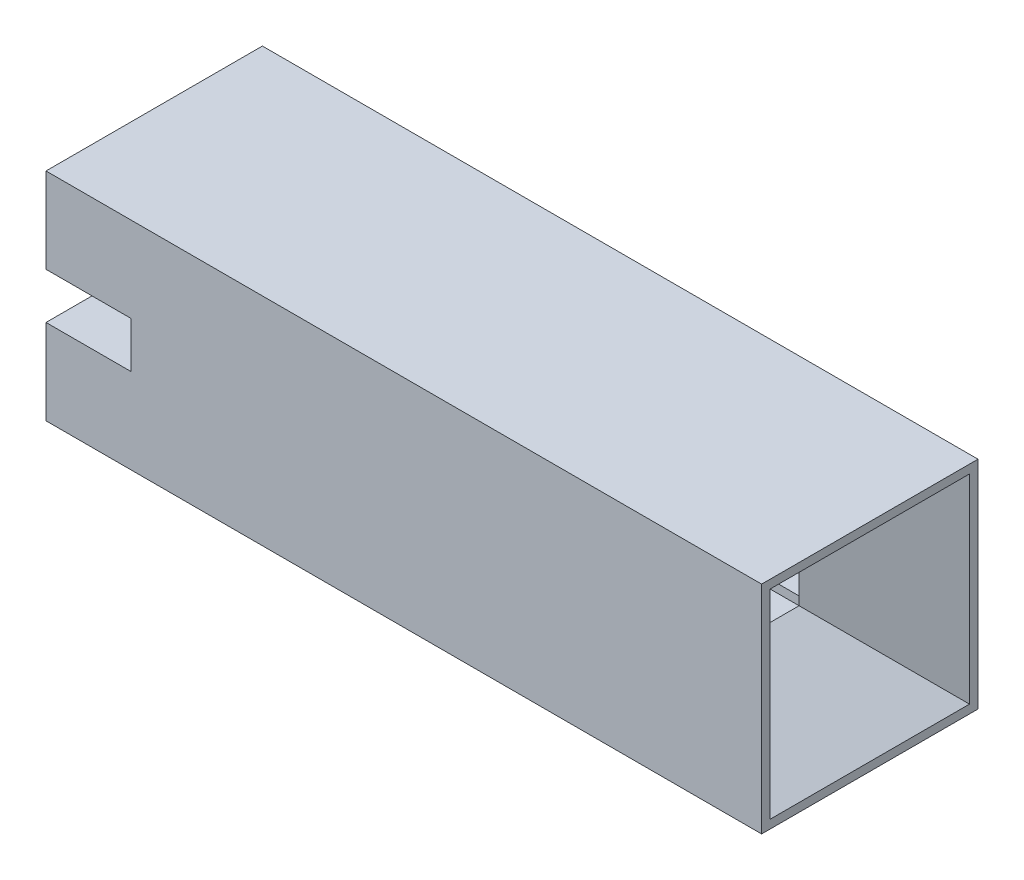
ISO-10303-21;
HEADER;
FILE_DESCRIPTION(('STEP AP214'),'2;1');
FILE_NAME('part.step','',(''),(''),'','','');
FILE_SCHEMA(('AUTOMOTIVE_DESIGN { 1 0 10303 214 1 1 1 1 }'));
ENDSEC;
DATA;
#1=APPLICATION_CONTEXT('core data for automotive mechanical design processes');
#2=APPLICATION_PROTOCOL_DEFINITION('international standard','automotive_design',2000,#1);
#3=PRODUCT_CONTEXT('',#1,'mechanical');
#4=PRODUCT('Part','Part','',(#3));
#5=PRODUCT_RELATED_PRODUCT_CATEGORY('part','',(#4));
#6=PRODUCT_DEFINITION_FORMATION('','',#4);
#7=PRODUCT_DEFINITION_CONTEXT('part definition',#1,'design');
#8=PRODUCT_DEFINITION('design','',#6,#7);
#9=PRODUCT_DEFINITION_SHAPE('','',#8);
#10=(LENGTH_UNIT() NAMED_UNIT(*) SI_UNIT(.MILLI.,.METRE.));
#11=(NAMED_UNIT(*) PLANE_ANGLE_UNIT() SI_UNIT($,.RADIAN.));
#12=(NAMED_UNIT(*) SI_UNIT($,.STERADIAN.) SOLID_ANGLE_UNIT());
#13=UNCERTAINTY_MEASURE_WITH_UNIT(LENGTH_MEASURE(1.E-05),#10,'distance_accuracy_value','');
#14=(GEOMETRIC_REPRESENTATION_CONTEXT(3) GLOBAL_UNCERTAINTY_ASSIGNED_CONTEXT((#13)) GLOBAL_UNIT_ASSIGNED_CONTEXT((#10,
#11,#12)) REPRESENTATION_CONTEXT('',''));
#15=CARTESIAN_POINT('',(0.,0.,0.));
#16=DIRECTION('',(0.,0.,1.));
#17=DIRECTION('',(1.,0.,0.));
#18=AXIS2_PLACEMENT_3D('',#15,#16,#17);
#19=CARTESIAN_POINT('',(-0.000999999999999265,1.64,1.64));
#20=DIRECTION('',(0.,0.,1.));
#21=DIRECTION('',(1.,0.,0.));
#22=AXIS2_PLACEMENT_3D('',#19,#20,#21);
#23=PLANE('',#22);
#24=DIRECTION('',(1.,0.,0.));
#25=VECTOR('',#24,1.);
#26=CARTESIAN_POINT('',(-0.000999999999999265,1.,1.64));
#27=LINE('',#26,#25);
#28=CARTESIAN_POINT('',(0.,1.,1.64));
#29=VERTEX_POINT('',#28);
#30=CARTESIAN_POINT('',(7.2,1.,1.64));
#31=VERTEX_POINT('',#30);
#32=EDGE_CURVE('E271',#29,#31,#27,.T.);
#33=ORIENTED_EDGE('',*,*,#32,.T.);
#34=DIRECTION('',(0.,-1.,0.));
#35=VECTOR('',#34,1.);
#36=CARTESIAN_POINT('',(7.2,1.64000000000001,1.64));
#37=LINE('',#36,#35);
#38=CARTESIAN_POINT('',(7.20000000000001,0.9,1.64));
#39=VERTEX_POINT('',#38);
#40=EDGE_CURVE('E362',#31,#39,#37,.T.);
#41=ORIENTED_EDGE('',*,*,#40,.T.);
#42=DIRECTION('',(1.,0.,0.));
#43=VECTOR('',#42,1.);
#44=CARTESIAN_POINT('',(-0.000999999999999265,0.9,1.64));
#45=LINE('',#44,#43);
#46=CARTESIAN_POINT('',(0.,0.9,1.64));
#47=VERTEX_POINT('',#46);
#48=EDGE_CURVE('E299',#47,#39,#45,.T.);
#49=ORIENTED_EDGE('',*,*,#48,.F.);
#50=DIRECTION('',(0.,1.,0.));
#51=VECTOR('',#50,1.);
#52=CARTESIAN_POINT('',(0.,1.64,1.64));
#53=LINE('',#52,#51);
#54=EDGE_CURVE('E295',#47,#29,#53,.T.);
#55=ORIENTED_EDGE('',*,*,#54,.T.);
#56=EDGE_LOOP('',(#33,#41,#49,#55));
#57=FACE_BOUND('',#56,.T.);
#58=ADVANCED_FACE('F38',(#57),#23,.F.);
#59=CARTESIAN_POINT('',(-0.000999999999999265,1.64,0.9));
#60=DIRECTION('',(0.,0.,-1.));
#61=DIRECTION('',(0.,1.,0.));
#62=AXIS2_PLACEMENT_3D('',#59,#60,#61);
#63=PLANE('',#62);
#64=DIRECTION('',(0.,1.,0.));
#65=VECTOR('',#64,1.);
#66=CARTESIAN_POINT('',(7.2,1.64000000000001,0.9));
#67=LINE('',#66,#65);
#68=CARTESIAN_POINT('',(7.2,0.900000000000011,0.9));
#69=VERTEX_POINT('',#68);
#70=CARTESIAN_POINT('',(7.2,1.,0.900000000000001));
#71=VERTEX_POINT('',#70);
#72=EDGE_CURVE('E384',#69,#71,#67,.T.);
#73=ORIENTED_EDGE('',*,*,#72,.T.);
#74=DIRECTION('',(-1.,0.,0.));
#75=VECTOR('',#74,1.);
#76=CARTESIAN_POINT('',(-0.000999999999999265,1.,0.9));
#77=LINE('',#76,#75);
#78=CARTESIAN_POINT('',(0.,1.,0.9));
#79=VERTEX_POINT('',#78);
#80=EDGE_CURVE('E47',#71,#79,#77,.T.);
#81=ORIENTED_EDGE('',*,*,#80,.T.);
#82=DIRECTION('',(0.,-1.,0.));
#83=VECTOR('',#82,1.);
#84=CARTESIAN_POINT('',(0.,1.64,0.9));
#85=LINE('',#84,#83);
#86=CARTESIAN_POINT('',(0.,0.900000000000011,0.9));
#87=VERTEX_POINT('',#86);
#88=EDGE_CURVE('E290',#79,#87,#85,.T.);
#89=ORIENTED_EDGE('',*,*,#88,.T.);
#90=DIRECTION('',(1.,0.,0.));
#91=VECTOR('',#90,1.);
#92=CARTESIAN_POINT('',(-0.000999999999999265,0.900000000000011,0.9));
#93=LINE('',#92,#91);
#94=EDGE_CURVE('E308',#87,#69,#93,.T.);
#95=ORIENTED_EDGE('',*,*,#94,.T.);
#96=EDGE_LOOP('',(#73,#81,#89,#95));
#97=FACE_BOUND('',#96,.T.);
#98=ADVANCED_FACE('F408',(#97),#63,.F.);
#99=CARTESIAN_POINT('',(0.,0.,2.54));
#100=DIRECTION('',(1.,0.,0.));
#101=DIRECTION('',(0.,0.,-1.));
#102=AXIS2_PLACEMENT_3D('',#99,#100,#101);
#103=PLANE('',#102);
#104=DIRECTION('',(0.,-1.,0.));
#105=VECTOR('',#104,1.);
#106=CARTESIAN_POINT('',(0.,0.,0.));
#107=LINE('',#106,#105);
#108=CARTESIAN_POINT('',(0.,2.54,0.));
#109=VERTEX_POINT('',#108);
#110=CARTESIAN_POINT('',(0.,1.54,0.));
#111=VERTEX_POINT('',#110);
#112=EDGE_CURVE('E334',#109,#111,#107,.T.);
#113=ORIENTED_EDGE('',*,*,#112,.T.);
#114=DIRECTION('',(0.,0.,-1.));
#115=VECTOR('',#114,1.);
#116=CARTESIAN_POINT('',(0.,1.54,0.));
#117=LINE('',#116,#115);
#118=CARTESIAN_POINT('',(0.,1.54,0.9));
#119=VERTEX_POINT('',#118);
#120=EDGE_CURVE('E264',#119,#111,#117,.T.);
#121=ORIENTED_EDGE('',*,*,#120,.F.);
#122=CARTESIAN_POINT('',(0.,1.64,0.9));
#123=VERTEX_POINT('',#122);
#124=EDGE_CURVE('E285',#123,#119,#85,.T.);
#125=ORIENTED_EDGE('',*,*,#124,.F.);
#126=DIRECTION('',(0.,0.,-1.));
#127=VECTOR('',#126,1.);
#128=CARTESIAN_POINT('',(0.,1.64,1.64));
#129=LINE('',#128,#127);
#130=CARTESIAN_POINT('',(0.,1.64,1.64));
#131=VERTEX_POINT('',#130);
#132=EDGE_CURVE('E289',#131,#123,#129,.T.);
#133=ORIENTED_EDGE('',*,*,#132,.F.);
#134=CARTESIAN_POINT('',(0.,1.54,1.64));
#135=VERTEX_POINT('',#134);
#136=EDGE_CURVE('E294',#135,#131,#53,.T.);
#137=ORIENTED_EDGE('',*,*,#136,.F.);
#138=CARTESIAN_POINT('',(0.,1.54,2.54));
#139=VERTEX_POINT('',#138);
#140=EDGE_CURVE('E248',#139,#135,#117,.T.);
#141=ORIENTED_EDGE('',*,*,#140,.F.);
#142=DIRECTION('',(0.,-1.,0.));
#143=VECTOR('',#142,1.);
#144=CARTESIAN_POINT('',(0.,0.,2.54));
#145=LINE('',#144,#143);
#146=CARTESIAN_POINT('',(0.,2.54,2.54));
#147=VERTEX_POINT('',#146);
#148=EDGE_CURVE('E319',#147,#139,#145,.T.);
#149=ORIENTED_EDGE('',*,*,#148,.F.);
#150=DIRECTION('',(0.,0.,-1.));
#151=VECTOR('',#150,1.);
#152=CARTESIAN_POINT('',(0.,2.54,2.54));
#153=LINE('',#152,#151);
#154=EDGE_CURVE('E333',#147,#109,#153,.T.);
#155=ORIENTED_EDGE('',*,*,#154,.T.);
#156=EDGE_LOOP('',(#113,#121,#125,#133,#137,#141,#149,#155));
#157=FACE_BOUND('',#156,.T.);
#158=ADVANCED_FACE('F497',(#157),#103,.F.);
#159=CARTESIAN_POINT('',(0.,1.,2.54));
#160=VERTEX_POINT('',#159);
#161=CARTESIAN_POINT('',(0.,0.,2.54));
#162=VERTEX_POINT('',#161);
#163=EDGE_CURVE('E324',#160,#162,#145,.T.);
#164=ORIENTED_EDGE('',*,*,#163,.F.);
#165=DIRECTION('',(0.,0.,1.));
#166=VECTOR('',#165,1.);
#167=CARTESIAN_POINT('',(0.,1.,0.));
#168=LINE('',#167,#166);
#169=EDGE_CURVE('E242',#29,#160,#168,.T.);
#170=ORIENTED_EDGE('',*,*,#169,.F.);
#171=ORIENTED_EDGE('',*,*,#54,.F.);
#172=DIRECTION('',(0.,0.,1.));
#173=VECTOR('',#172,1.);
#174=CARTESIAN_POINT('',(0.,0.9,1.64));
#175=LINE('',#174,#173);
#176=EDGE_CURVE('E304',#87,#47,#175,.T.);
#177=ORIENTED_EDGE('',*,*,#176,.F.);
#178=ORIENTED_EDGE('',*,*,#88,.F.);
#179=CARTESIAN_POINT('',(0.,1.,0.));
#180=VERTEX_POINT('',#179);
#181=EDGE_CURVE('E261',#180,#79,#168,.T.);
#182=ORIENTED_EDGE('',*,*,#181,.F.);
#183=CARTESIAN_POINT('',(0.,0.,0.));
#184=VERTEX_POINT('',#183);
#185=EDGE_CURVE('E318',#180,#184,#107,.T.);
#186=ORIENTED_EDGE('',*,*,#185,.T.);
#187=DIRECTION('',(0.,0.,-1.));
#188=VECTOR('',#187,1.);
#189=CARTESIAN_POINT('',(0.,0.,2.54));
#190=LINE('',#189,#188);
#191=EDGE_CURVE('E358',#162,#184,#190,.T.);
#192=ORIENTED_EDGE('',*,*,#191,.F.);
#193=EDGE_LOOP('',(#164,#170,#171,#177,#178,#182,#186,#192));
#194=FACE_BOUND('',#193,.T.);
#195=ADVANCED_FACE('F417',(#194),#103,.F.);
#196=CARTESIAN_POINT('',(0.,0.,2.54));
#197=DIRECTION('',(0.,1.,0.));
#198=DIRECTION('',(0.,0.,1.));
#199=AXIS2_PLACEMENT_3D('',#196,#197,#198);
#200=PLANE('',#199);
#201=DIRECTION('',(1.,0.,0.));
#202=VECTOR('',#201,1.);
#203=CARTESIAN_POINT('',(0.,0.,0.));
#204=LINE('',#203,#202);
#205=CARTESIAN_POINT('',(8.4,0.,0.));
#206=VERTEX_POINT('',#205);
#207=EDGE_CURVE('E338',#184,#206,#204,.T.);
#208=ORIENTED_EDGE('',*,*,#207,.T.);
#209=DIRECTION('',(0.,0.,-1.));
#210=VECTOR('',#209,1.);
#211=CARTESIAN_POINT('',(8.4,0.,2.54));
#212=LINE('',#211,#210);
#213=CARTESIAN_POINT('',(8.4,0.,2.54));
#214=VERTEX_POINT('',#213);
#215=EDGE_CURVE('E354',#214,#206,#212,.T.);
#216=ORIENTED_EDGE('',*,*,#215,.F.);
#217=DIRECTION('',(1.,0.,0.));
#218=VECTOR('',#217,1.);
#219=CARTESIAN_POINT('',(0.,0.,2.54));
#220=LINE('',#219,#218);
#221=EDGE_CURVE('E323',#162,#214,#220,.T.);
#222=ORIENTED_EDGE('',*,*,#221,.F.);
#223=ORIENTED_EDGE('',*,*,#191,.T.);
#224=EDGE_LOOP('',(#208,#216,#222,#223));
#225=FACE_BOUND('',#224,.T.);
#226=ADVANCED_FACE('F484',(#225),#200,.F.);
#227=CARTESIAN_POINT('',(8.4,0.,2.54));
#228=DIRECTION('',(-1.,0.,0.));
#229=DIRECTION('',(0.,-1.,0.));
#230=AXIS2_PLACEMENT_3D('',#227,#228,#229);
#231=PLANE('',#230);
#232=DIRECTION('',(0.,0.,1.));
#233=VECTOR('',#232,1.);
#234=CARTESIAN_POINT('',(8.4,0.09999999999999,2.54));
#235=LINE('',#234,#233);
#236=CARTESIAN_POINT('',(8.4,0.100000000000028,0.100000000000002));
#237=VERTEX_POINT('',#236);
#238=CARTESIAN_POINT('',(8.4,0.0999999999999915,2.44));
#239=VERTEX_POINT('',#238);
#240=EDGE_CURVE('E374',#237,#239,#235,.T.);
#241=ORIENTED_EDGE('',*,*,#240,.T.);
#242=DIRECTION('',(0.,1.,0.));
#243=VECTOR('',#242,1.);
#244=CARTESIAN_POINT('',(8.4,0.,2.44));
#245=LINE('',#244,#243);
#246=CARTESIAN_POINT('',(8.4,2.44,2.44));
#247=VERTEX_POINT('',#246);
#248=EDGE_CURVE('E377',#239,#247,#245,.T.);
#249=ORIENTED_EDGE('',*,*,#248,.T.);
#250=DIRECTION('',(0.,0.,-1.));
#251=VECTOR('',#250,1.);
#252=CARTESIAN_POINT('',(8.4,2.44,2.54));
#253=LINE('',#252,#251);
#254=CARTESIAN_POINT('',(8.4,2.44,0.100000000000002));
#255=VERTEX_POINT('',#254);
#256=EDGE_CURVE('E367',#247,#255,#253,.T.);
#257=ORIENTED_EDGE('',*,*,#256,.T.);
#258=DIRECTION('',(0.,-1.,0.));
#259=VECTOR('',#258,1.);
#260=CARTESIAN_POINT('',(8.4,0.,0.100000000000002));
#261=LINE('',#260,#259);
#262=EDGE_CURVE('E371',#255,#237,#261,.T.);
#263=ORIENTED_EDGE('',*,*,#262,.T.);
#264=EDGE_LOOP('',(#241,#249,#257,#263));
#265=FACE_BOUND('',#264,.T.);
#266=DIRECTION('',(0.,1.,0.));
#267=VECTOR('',#266,1.);
#268=CARTESIAN_POINT('',(8.4,0.,0.));
#269=LINE('',#268,#267);
#270=CARTESIAN_POINT('',(8.4,2.54,0.));
#271=VERTEX_POINT('',#270);
#272=EDGE_CURVE('E341',#206,#271,#269,.T.);
#273=ORIENTED_EDGE('',*,*,#272,.T.);
#274=DIRECTION('',(0.,0.,-1.));
#275=VECTOR('',#274,1.);
#276=CARTESIAN_POINT('',(8.4,2.54,2.54));
#277=LINE('',#276,#275);
#278=CARTESIAN_POINT('',(8.4,2.54,2.54));
#279=VERTEX_POINT('',#278);
#280=EDGE_CURVE('E350',#279,#271,#277,.T.);
#281=ORIENTED_EDGE('',*,*,#280,.F.);
#282=DIRECTION('',(0.,1.,0.));
#283=VECTOR('',#282,1.);
#284=CARTESIAN_POINT('',(8.4,0.,2.54));
#285=LINE('',#284,#283);
#286=EDGE_CURVE('E327',#214,#279,#285,.T.);
#287=ORIENTED_EDGE('',*,*,#286,.F.);
#288=ORIENTED_EDGE('',*,*,#215,.T.);
#289=EDGE_LOOP('',(#273,#281,#287,#288));
#290=FACE_BOUND('',#289,.T.);
#291=ADVANCED_FACE('F491',(#265,#290),#231,.F.);
#292=CARTESIAN_POINT('',(0.,2.54,2.54));
#293=DIRECTION('',(0.,-1.,0.));
#294=DIRECTION('',(0.,0.,-1.));
#295=AXIS2_PLACEMENT_3D('',#292,#293,#294);
#296=PLANE('',#295);
#297=DIRECTION('',(-1.,0.,0.));
#298=VECTOR('',#297,1.);
#299=CARTESIAN_POINT('',(0.,2.54,0.));
#300=LINE('',#299,#298);
#301=EDGE_CURVE('E344',#271,#109,#300,.T.);
#302=ORIENTED_EDGE('',*,*,#301,.T.);
#303=ORIENTED_EDGE('',*,*,#154,.F.);
#304=DIRECTION('',(-1.,0.,0.));
#305=VECTOR('',#304,1.);
#306=CARTESIAN_POINT('',(0.,2.54,2.54));
#307=LINE('',#306,#305);
#308=EDGE_CURVE('E330',#279,#147,#307,.T.);
#309=ORIENTED_EDGE('',*,*,#308,.F.);
#310=ORIENTED_EDGE('',*,*,#280,.T.);
#311=EDGE_LOOP('',(#302,#303,#309,#310));
#312=FACE_BOUND('',#311,.T.);
#313=ADVANCED_FACE('F495',(#312),#296,.F.);
#314=CARTESIAN_POINT('',(0.,0.,2.54));
#315=DIRECTION('',(0.,0.,-1.));
#316=DIRECTION('',(-1.,0.,0.));
#317=AXIS2_PLACEMENT_3D('',#314,#315,#316);
#318=PLANE('',#317);
#319=ORIENTED_EDGE('',*,*,#148,.T.);
#320=DIRECTION('',(-1.,0.,0.));
#321=VECTOR('',#320,1.);
#322=CARTESIAN_POINT('',(1.,1.54,2.54));
#323=LINE('',#322,#321);
#324=CARTESIAN_POINT('',(1.,1.54,2.54));
#325=VERTEX_POINT('',#324);
#326=EDGE_CURVE('E272',#325,#139,#323,.T.);
#327=ORIENTED_EDGE('',*,*,#326,.F.);
#328=DIRECTION('',(0.,1.,0.));
#329=VECTOR('',#328,1.);
#330=CARTESIAN_POINT('',(1.,1.54,2.54));
#331=LINE('',#330,#329);
#332=CARTESIAN_POINT('',(1.,1.,2.54));
#333=VERTEX_POINT('',#332);
#334=EDGE_CURVE('E253',#333,#325,#331,.T.);
#335=ORIENTED_EDGE('',*,*,#334,.F.);
#336=DIRECTION('',(-1.,0.,0.));
#337=VECTOR('',#336,1.);
#338=CARTESIAN_POINT('',(1.,1.,2.54));
#339=LINE('',#338,#337);
#340=EDGE_CURVE('E275',#333,#160,#339,.T.);
#341=ORIENTED_EDGE('',*,*,#340,.T.);
#342=ORIENTED_EDGE('',*,*,#163,.T.);
#343=ORIENTED_EDGE('',*,*,#221,.T.);
#344=ORIENTED_EDGE('',*,*,#286,.T.);
#345=ORIENTED_EDGE('',*,*,#308,.T.);
#346=EDGE_LOOP('',(#319,#327,#335,#341,#342,#343,#344,#345));
#347=FACE_BOUND('',#346,.T.);
#348=ADVANCED_FACE('F478',(#347),#318,.F.);
#349=CARTESIAN_POINT('',(0.,0.,0.));
#350=DIRECTION('',(0.,0.,-1.));
#351=DIRECTION('',(-1.,0.,0.));
#352=AXIS2_PLACEMENT_3D('',#349,#350,#351);
#353=PLANE('',#352);
#354=DIRECTION('',(-1.,0.,0.));
#355=VECTOR('',#354,1.);
#356=CARTESIAN_POINT('',(1.,1.54,0.));
#357=LINE('',#356,#355);
#358=CARTESIAN_POINT('',(1.,1.54,0.));
#359=VERTEX_POINT('',#358);
#360=EDGE_CURVE('E267',#359,#111,#357,.T.);
#361=ORIENTED_EDGE('',*,*,#360,.T.);
#362=ORIENTED_EDGE('',*,*,#112,.F.);
#363=ORIENTED_EDGE('',*,*,#301,.F.);
#364=ORIENTED_EDGE('',*,*,#272,.F.);
#365=ORIENTED_EDGE('',*,*,#207,.F.);
#366=ORIENTED_EDGE('',*,*,#185,.F.);
#367=DIRECTION('',(-1.,0.,0.));
#368=VECTOR('',#367,1.);
#369=CARTESIAN_POINT('',(1.,1.,0.));
#370=LINE('',#369,#368);
#371=CARTESIAN_POINT('',(1.,1.,0.));
#372=VERTEX_POINT('',#371);
#373=EDGE_CURVE('E260',#372,#180,#370,.T.);
#374=ORIENTED_EDGE('',*,*,#373,.F.);
#375=DIRECTION('',(0.,-1.,0.));
#376=VECTOR('',#375,1.);
#377=CARTESIAN_POINT('',(1.,1.54,0.));
#378=LINE('',#377,#376);
#379=EDGE_CURVE('E243',#359,#372,#378,.T.);
#380=ORIENTED_EDGE('',*,*,#379,.F.);
#381=EDGE_LOOP('',(#361,#362,#363,#364,#365,#366,#374,#380));
#382=FACE_BOUND('',#381,.T.);
#383=ADVANCED_FACE('F440',(#382),#353,.T.);
#384=CARTESIAN_POINT('',(7.2,1.64,1.64));
#385=VERTEX_POINT('',#384);
#386=CARTESIAN_POINT('',(7.2,1.54,1.64));
#387=VERTEX_POINT('',#386);
#388=EDGE_CURVE('E363',#385,#387,#37,.T.);
#389=ORIENTED_EDGE('',*,*,#388,.T.);
#390=DIRECTION('',(-1.,0.,0.));
#391=VECTOR('',#390,1.);
#392=CARTESIAN_POINT('',(-0.000999999999999265,1.54,1.64));
#393=LINE('',#392,#391);
#394=EDGE_CURVE('E201',#387,#135,#393,.T.);
#395=ORIENTED_EDGE('',*,*,#394,.T.);
#396=ORIENTED_EDGE('',*,*,#136,.T.);
#397=DIRECTION('',(1.,0.,0.));
#398=VECTOR('',#397,1.);
#399=CARTESIAN_POINT('',(-0.000999999999999265,1.64,1.64));
#400=LINE('',#399,#398);
#401=EDGE_CURVE('E300',#131,#385,#400,.T.);
#402=ORIENTED_EDGE('',*,*,#401,.T.);
#403=EDGE_LOOP('',(#389,#395,#396,#402));
#404=FACE_BOUND('',#403,.T.);
#405=ADVANCED_FACE('F464',(#404),#23,.F.);
#406=CARTESIAN_POINT('',(-0.000999999999999265,1.64,1.64));
#407=DIRECTION('',(0.,1.,0.));
#408=DIRECTION('',(0.,0.,1.));
#409=AXIS2_PLACEMENT_3D('',#406,#407,#408);
#410=PLANE('',#409);
#411=DIRECTION('',(1.,0.,0.));
#412=VECTOR('',#411,1.);
#413=CARTESIAN_POINT('',(-0.000999999999999265,1.64,0.9));
#414=LINE('',#413,#412);
#415=CARTESIAN_POINT('',(7.2,1.64,0.9));
#416=VERTEX_POINT('',#415);
#417=EDGE_CURVE('E305',#123,#416,#414,.T.);
#418=ORIENTED_EDGE('',*,*,#417,.T.);
#419=DIRECTION('',(0.,0.,1.));
#420=VECTOR('',#419,1.);
#421=CARTESIAN_POINT('',(7.2,1.64,1.64));
#422=LINE('',#421,#420);
#423=EDGE_CURVE('E388',#416,#385,#422,.T.);
#424=ORIENTED_EDGE('',*,*,#423,.T.);
#425=ORIENTED_EDGE('',*,*,#401,.F.);
#426=ORIENTED_EDGE('',*,*,#132,.T.);
#427=EDGE_LOOP('',(#418,#424,#425,#426));
#428=FACE_BOUND('',#427,.T.);
#429=ADVANCED_FACE('F461',(#428),#410,.F.);
#430=DIRECTION('',(1.,0.,0.));
#431=VECTOR('',#430,1.);
#432=CARTESIAN_POINT('',(-0.000999999999999265,1.54,0.9));
#433=LINE('',#432,#431);
#434=CARTESIAN_POINT('',(7.2,1.54,0.900000000000001));
#435=VERTEX_POINT('',#434);
#436=EDGE_CURVE('E11',#119,#435,#433,.T.);
#437=ORIENTED_EDGE('',*,*,#436,.T.);
#438=EDGE_CURVE('E61',#435,#416,#67,.T.);
#439=ORIENTED_EDGE('',*,*,#438,.T.);
#440=ORIENTED_EDGE('',*,*,#417,.F.);
#441=ORIENTED_EDGE('',*,*,#124,.T.);
#442=EDGE_LOOP('',(#437,#439,#440,#441));
#443=FACE_BOUND('',#442,.T.);
#444=ADVANCED_FACE('F528',(#443),#63,.F.);
#445=CARTESIAN_POINT('',(-0.000999999999999265,0.9,1.64));
#446=DIRECTION('',(0.,-1.,0.));
#447=DIRECTION('',(0.,0.,-1.));
#448=AXIS2_PLACEMENT_3D('',#445,#446,#447);
#449=PLANE('',#448);
#450=ORIENTED_EDGE('',*,*,#48,.T.);
#451=DIRECTION('',(0.,0.,-1.));
#452=VECTOR('',#451,1.);
#453=CARTESIAN_POINT('',(7.20000000000001,0.9,1.64));
#454=LINE('',#453,#452);
#455=EDGE_CURVE('E381',#39,#69,#454,.T.);
#456=ORIENTED_EDGE('',*,*,#455,.T.);
#457=ORIENTED_EDGE('',*,*,#94,.F.);
#458=ORIENTED_EDGE('',*,*,#176,.T.);
#459=EDGE_LOOP('',(#450,#456,#457,#458));
#460=FACE_BOUND('',#459,.T.);
#461=ADVANCED_FACE('F509',(#460),#449,.F.);
#462=CARTESIAN_POINT('',(7.2,1.64000000000001,0.9));
#463=DIRECTION('',(-0.554700196225228,0.,-0.832050294337844));
#464=DIRECTION('',(0.,1.,0.));
#465=AXIS2_PLACEMENT_3D('',#462,#463,#464);
#466=PLANE('',#465);
#467=DIRECTION('',(0.727606875109003,-0.485071250072659,-0.485071250072667));
#468=VECTOR('',#467,1.);
#469=CARTESIAN_POINT('',(6.93882352941177,1.07411764705883,1.07411764705882));
#470=LINE('',#469,#468);
#471=EDGE_CURVE('E397',#237,#69,#470,.F.);
#472=ORIENTED_EDGE('',*,*,#471,.F.);
#473=ORIENTED_EDGE('',*,*,#262,.F.);
#474=DIRECTION('',(0.727606875108999,0.485071250072666,-0.485071250072665));
#475=VECTOR('',#474,1.);
#476=CARTESIAN_POINT('',(7.20000000000001,1.64,0.899999999999998));
#477=LINE('',#476,#475);
#478=EDGE_CURVE('E401',#416,#255,#477,.T.);
#479=ORIENTED_EDGE('',*,*,#478,.F.);
#480=ORIENTED_EDGE('',*,*,#438,.F.);
#481=DIRECTION('',(0.,1.,0.));
#482=VECTOR('',#481,1.);
#483=CARTESIAN_POINT('',(7.2,1.64000000000001,0.900000000000001));
#484=LINE('',#483,#482);
#485=EDGE_CURVE('E233',#435,#71,#484,.F.);
#486=ORIENTED_EDGE('',*,*,#485,.T.);
#487=ORIENTED_EDGE('',*,*,#72,.F.);
#488=EDGE_LOOP('',(#472,#473,#479,#480,#486,#487));
#489=FACE_BOUND('',#488,.T.);
#490=ADVANCED_FACE('F40',(#489),#466,.F.);
#491=CARTESIAN_POINT('',(7.2,1.64,1.64));
#492=DIRECTION('',(-0.554700196225229,0.832050294337844,0.));
#493=DIRECTION('',(0.,0.,1.));
#494=AXIS2_PLACEMENT_3D('',#491,#492,#493);
#495=PLANE('',#494);
#496=ORIENTED_EDGE('',*,*,#478,.T.);
#497=ORIENTED_EDGE('',*,*,#256,.F.);
#498=DIRECTION('',(-0.727606875108999,-0.485071250072666,-0.485071250072665));
#499=VECTOR('',#498,1.);
#500=CARTESIAN_POINT('',(7.20000000000001,1.64,1.64));
#501=LINE('',#500,#499);
#502=EDGE_CURVE('E394',#385,#247,#501,.F.);
#503=ORIENTED_EDGE('',*,*,#502,.F.);
#504=ORIENTED_EDGE('',*,*,#423,.F.);
#505=EDGE_LOOP('',(#496,#497,#503,#504));
#506=FACE_BOUND('',#505,.T.);
#507=ADVANCED_FACE('F457',(#506),#495,.F.);
#508=CARTESIAN_POINT('',(7.20000000000001,0.9,1.64));
#509=DIRECTION('',(-0.554700196225228,-0.832050294337845,0.));
#510=DIRECTION('',(0.,0.,-1.));
#511=AXIS2_PLACEMENT_3D('',#508,#509,#510);
#512=PLANE('',#511);
#513=ORIENTED_EDGE('',*,*,#471,.T.);
#514=ORIENTED_EDGE('',*,*,#455,.F.);
#515=DIRECTION('',(0.727606875108998,-0.485071250072671,0.485071250072663));
#516=VECTOR('',#515,1.);
#517=CARTESIAN_POINT('',(6.93882352941176,1.07411764705883,1.46588235294117));
#518=LINE('',#517,#516);
#519=EDGE_CURVE('E284',#239,#39,#518,.F.);
#520=ORIENTED_EDGE('',*,*,#519,.F.);
#521=ORIENTED_EDGE('',*,*,#240,.F.);
#522=EDGE_LOOP('',(#513,#514,#520,#521));
#523=FACE_BOUND('',#522,.T.);
#524=ADVANCED_FACE('F512',(#523),#512,.F.);
#525=CARTESIAN_POINT('',(7.2,1.64000000000001,1.64));
#526=DIRECTION('',(-0.554700196225228,0.,0.832050294337844));
#527=DIRECTION('',(0.,-1.,0.));
#528=AXIS2_PLACEMENT_3D('',#525,#526,#527);
#529=PLANE('',#528);
#530=ORIENTED_EDGE('',*,*,#502,.T.);
#531=ORIENTED_EDGE('',*,*,#248,.F.);
#532=ORIENTED_EDGE('',*,*,#519,.T.);
#533=ORIENTED_EDGE('',*,*,#40,.F.);
#534=EDGE_CURVE('E368',#387,#31,#37,.T.);
#535=ORIENTED_EDGE('',*,*,#534,.F.);
#536=ORIENTED_EDGE('',*,*,#388,.F.);
#537=EDGE_LOOP('',(#530,#531,#532,#533,#535,#536));
#538=FACE_BOUND('',#537,.T.);
#539=ADVANCED_FACE('F503',(#538),#529,.F.);
#540=CARTESIAN_POINT('',(1.,0.,0.));
#541=DIRECTION('',(-1.,0.,0.));
#542=DIRECTION('',(0.,0.,1.));
#543=AXIS2_PLACEMENT_3D('',#540,#541,#542);
#544=PLANE('',#543);
#545=DIRECTION('',(0.,-1.,0.));
#546=VECTOR('',#545,1.);
#547=CARTESIAN_POINT('',(1.,1.,0.4));
#548=LINE('',#547,#546);
#549=CARTESIAN_POINT('',(1.,1.54,0.4));
#550=VERTEX_POINT('',#549);
#551=CARTESIAN_POINT('',(1.,1.,0.4));
#552=VERTEX_POINT('',#551);
#553=EDGE_CURVE('E214',#550,#552,#548,.T.);
#554=ORIENTED_EDGE('',*,*,#553,.F.);
#555=DIRECTION('',(0.,0.,-1.));
#556=VECTOR('',#555,1.);
#557=CARTESIAN_POINT('',(1.,1.54,0.));
#558=LINE('',#557,#556);
#559=EDGE_CURVE('E256',#550,#359,#558,.T.);
#560=ORIENTED_EDGE('',*,*,#559,.T.);
#561=ORIENTED_EDGE('',*,*,#379,.T.);
#562=DIRECTION('',(0.,0.,1.));
#563=VECTOR('',#562,1.);
#564=CARTESIAN_POINT('',(1.,1.,0.));
#565=LINE('',#564,#563);
#566=EDGE_CURVE('E249',#372,#552,#565,.T.);
#567=ORIENTED_EDGE('',*,*,#566,.T.);
#568=EDGE_LOOP('',(#554,#560,#561,#567));
#569=FACE_BOUND('',#568,.T.);
#570=ADVANCED_FACE('F431',(#569),#544,.T.);
#571=CARTESIAN_POINT('',(1.,1.,0.));
#572=DIRECTION('',(0.,-1.,0.));
#573=DIRECTION('',(0.,0.,-1.));
#574=AXIS2_PLACEMENT_3D('',#571,#572,#573);
#575=PLANE('',#574);
#576=ORIENTED_EDGE('',*,*,#566,.F.);
#577=ORIENTED_EDGE('',*,*,#373,.T.);
#578=ORIENTED_EDGE('',*,*,#181,.T.);
#579=ORIENTED_EDGE('',*,*,#80,.F.);
#580=DIRECTION('',(0.,0.,1.));
#581=VECTOR('',#580,1.);
#582=CARTESIAN_POINT('',(7.2,1.,2.14));
#583=LINE('',#582,#581);
#584=CARTESIAN_POINT('',(7.2,1.,0.4));
#585=VERTEX_POINT('',#584);
#586=EDGE_CURVE('E195',#585,#71,#583,.T.);
#587=ORIENTED_EDGE('',*,*,#586,.F.);
#588=DIRECTION('',(-1.,0.,0.));
#589=VECTOR('',#588,1.);
#590=CARTESIAN_POINT('',(7.2,1.,0.4));
#591=LINE('',#590,#589);
#592=EDGE_CURVE('E234',#585,#552,#591,.T.);
#593=ORIENTED_EDGE('',*,*,#592,.T.);
#594=EDGE_LOOP('',(#576,#577,#578,#579,#587,#593));
#595=FACE_BOUND('',#594,.T.);
#596=ADVANCED_FACE('F442',(#595),#575,.F.);
#597=CARTESIAN_POINT('',(1.,1.54,0.));
#598=DIRECTION('',(0.,1.,0.));
#599=DIRECTION('',(0.,0.,1.));
#600=AXIS2_PLACEMENT_3D('',#597,#598,#599);
#601=PLANE('',#600);
#602=ORIENTED_EDGE('',*,*,#120,.T.);
#603=ORIENTED_EDGE('',*,*,#360,.F.);
#604=ORIENTED_EDGE('',*,*,#559,.F.);
#605=DIRECTION('',(-1.,0.,0.));
#606=VECTOR('',#605,1.);
#607=CARTESIAN_POINT('',(7.2,1.54,0.4));
#608=LINE('',#607,#606);
#609=CARTESIAN_POINT('',(7.2,1.54,0.4));
#610=VERTEX_POINT('',#609);
#611=EDGE_CURVE('E194',#610,#550,#608,.T.);
#612=ORIENTED_EDGE('',*,*,#611,.F.);
#613=DIRECTION('',(0.,0.,-1.));
#614=VECTOR('',#613,1.);
#615=CARTESIAN_POINT('',(7.2,1.54,2.14));
#616=LINE('',#615,#614);
#617=EDGE_CURVE('E207',#435,#610,#616,.T.);
#618=ORIENTED_EDGE('',*,*,#617,.F.);
#619=ORIENTED_EDGE('',*,*,#436,.F.);
#620=EDGE_LOOP('',(#602,#603,#604,#612,#618,#619));
#621=FACE_BOUND('',#620,.T.);
#622=ADVANCED_FACE('F436',(#621),#601,.F.);
#623=CARTESIAN_POINT('',(1.,1.54,2.14));
#624=VERTEX_POINT('',#623);
#625=EDGE_CURVE('E257',#325,#624,#558,.T.);
#626=ORIENTED_EDGE('',*,*,#625,.F.);
#627=ORIENTED_EDGE('',*,*,#326,.T.);
#628=ORIENTED_EDGE('',*,*,#140,.T.);
#629=ORIENTED_EDGE('',*,*,#394,.F.);
#630=CARTESIAN_POINT('',(7.2,1.54,2.14));
#631=VERTEX_POINT('',#630);
#632=EDGE_CURVE('E198',#631,#387,#616,.T.);
#633=ORIENTED_EDGE('',*,*,#632,.F.);
#634=DIRECTION('',(-1.,0.,0.));
#635=VECTOR('',#634,1.);
#636=CARTESIAN_POINT('',(7.2,1.54,2.14));
#637=LINE('',#636,#635);
#638=EDGE_CURVE('E185',#631,#624,#637,.T.);
#639=ORIENTED_EDGE('',*,*,#638,.T.);
#640=EDGE_LOOP('',(#626,#627,#628,#629,#633,#639));
#641=FACE_BOUND('',#640,.T.);
#642=ADVANCED_FACE('F199',(#641),#601,.F.);
#643=ORIENTED_EDGE('',*,*,#169,.T.);
#644=ORIENTED_EDGE('',*,*,#340,.F.);
#645=CARTESIAN_POINT('',(1.,1.,2.14));
#646=VERTEX_POINT('',#645);
#647=EDGE_CURVE('E247',#646,#333,#565,.T.);
#648=ORIENTED_EDGE('',*,*,#647,.F.);
#649=DIRECTION('',(-1.,0.,0.));
#650=VECTOR('',#649,1.);
#651=CARTESIAN_POINT('',(7.2,1.,2.14));
#652=LINE('',#651,#650);
#653=CARTESIAN_POINT('',(7.2,1.,2.14));
#654=VERTEX_POINT('',#653);
#655=EDGE_CURVE('E230',#654,#646,#652,.T.);
#656=ORIENTED_EDGE('',*,*,#655,.F.);
#657=EDGE_CURVE('E211',#31,#654,#583,.T.);
#658=ORIENTED_EDGE('',*,*,#657,.F.);
#659=ORIENTED_EDGE('',*,*,#32,.F.);
#660=EDGE_LOOP('',(#643,#644,#648,#656,#658,#659));
#661=FACE_BOUND('',#660,.T.);
#662=ADVANCED_FACE('F474',(#661),#575,.F.);
#663=DIRECTION('',(0.,1.,0.));
#664=VECTOR('',#663,1.);
#665=CARTESIAN_POINT('',(1.,1.,2.14));
#666=LINE('',#665,#664);
#667=EDGE_CURVE('E54',#646,#624,#666,.T.);
#668=ORIENTED_EDGE('',*,*,#667,.F.);
#669=ORIENTED_EDGE('',*,*,#647,.T.);
#670=ORIENTED_EDGE('',*,*,#334,.T.);
#671=ORIENTED_EDGE('',*,*,#625,.T.);
#672=EDGE_LOOP('',(#668,#669,#670,#671));
#673=FACE_BOUND('',#672,.T.);
#674=ADVANCED_FACE('F499',(#673),#544,.T.);
#675=CARTESIAN_POINT('',(7.2,1.,2.14));
#676=DIRECTION('',(0.,0.,1.));
#677=DIRECTION('',(1.,0.,0.));
#678=AXIS2_PLACEMENT_3D('',#675,#676,#677);
#679=PLANE('',#678);
#680=ORIENTED_EDGE('',*,*,#667,.T.);
#681=ORIENTED_EDGE('',*,*,#638,.F.);
#682=DIRECTION('',(0.,1.,0.));
#683=VECTOR('',#682,1.);
#684=CARTESIAN_POINT('',(7.2,1.,2.14));
#685=LINE('',#684,#683);
#686=EDGE_CURVE('E189',#654,#631,#685,.T.);
#687=ORIENTED_EDGE('',*,*,#686,.F.);
#688=ORIENTED_EDGE('',*,*,#655,.T.);
#689=EDGE_LOOP('',(#680,#681,#687,#688));
#690=FACE_BOUND('',#689,.T.);
#691=ADVANCED_FACE('F187',(#690),#679,.F.);
#692=CARTESIAN_POINT('',(7.2,0.,0.));
#693=DIRECTION('',(-1.,0.,0.));
#694=DIRECTION('',(0.,0.,1.));
#695=AXIS2_PLACEMENT_3D('',#692,#693,#694);
#696=PLANE('',#695);
#697=ORIENTED_EDGE('',*,*,#657,.T.);
#698=ORIENTED_EDGE('',*,*,#686,.T.);
#699=ORIENTED_EDGE('',*,*,#632,.T.);
#700=ORIENTED_EDGE('',*,*,#534,.T.);
#701=EDGE_LOOP('',(#697,#698,#699,#700));
#702=FACE_BOUND('',#701,.T.);
#703=ADVANCED_FACE('F209',(#702),#696,.T.);
#704=ORIENTED_EDGE('',*,*,#617,.T.);
#705=DIRECTION('',(0.,-1.,0.));
#706=VECTOR('',#705,1.);
#707=CARTESIAN_POINT('',(7.2,1.,0.4));
#708=LINE('',#707,#706);
#709=EDGE_CURVE('E206',#610,#585,#708,.T.);
#710=ORIENTED_EDGE('',*,*,#709,.T.);
#711=ORIENTED_EDGE('',*,*,#586,.T.);
#712=ORIENTED_EDGE('',*,*,#485,.F.);
#713=EDGE_LOOP('',(#704,#710,#711,#712));
#714=FACE_BOUND('',#713,.T.);
#715=ADVANCED_FACE('F699',(#714),#696,.T.);
#716=CARTESIAN_POINT('',(7.2,1.,0.4));
#717=DIRECTION('',(0.,0.,-1.));
#718=DIRECTION('',(-1.,0.,0.));
#719=AXIS2_PLACEMENT_3D('',#716,#717,#718);
#720=PLANE('',#719);
#721=ORIENTED_EDGE('',*,*,#553,.T.);
#722=ORIENTED_EDGE('',*,*,#592,.F.);
#723=ORIENTED_EDGE('',*,*,#709,.F.);
#724=ORIENTED_EDGE('',*,*,#611,.T.);
#725=EDGE_LOOP('',(#721,#722,#723,#724));
#726=FACE_BOUND('',#725,.T.);
#727=ADVANCED_FACE('F445',(#726),#720,.F.);
#728=CLOSED_SHELL('',(#58,#98,#158,#195,#226,#291,#313,#348,#383,#405,#429,#444,#461,#490,#507,
#524,#539,#570,#596,#622,#642,#662,#674,#691,#703,#715,#727));
#729=MANIFOLD_SOLID_BREP('B2',#728);
#730=ADVANCED_BREP_SHAPE_REPRESENTATION('',(#18,#729),#14);
#731=SHAPE_DEFINITION_REPRESENTATION(#9,#730);
ENDSEC;
END-ISO-10303-21;
